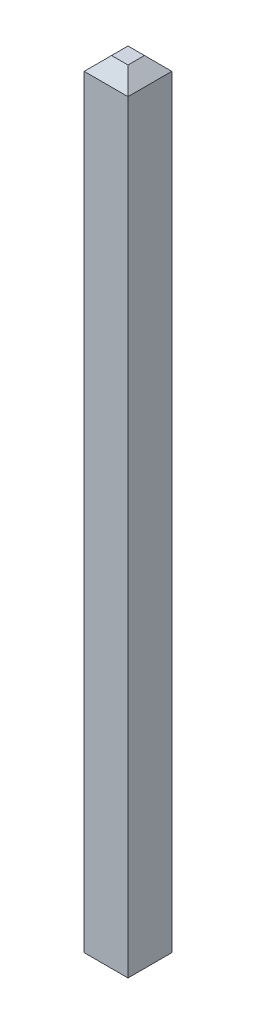
ISO-10303-21;
HEADER;
FILE_DESCRIPTION(('STEP AP214'),'2;1');
FILE_NAME('part.step','',(''),(''),'','','');
FILE_SCHEMA(('AUTOMOTIVE_DESIGN { 1 0 10303 214 1 1 1 1 }'));
ENDSEC;
DATA;
#1=APPLICATION_CONTEXT('core data for automotive mechanical design processes');
#2=APPLICATION_PROTOCOL_DEFINITION('international standard','automotive_design',2000,#1);
#3=PRODUCT_CONTEXT('',#1,'mechanical');
#4=PRODUCT('Part','Part','',(#3));
#5=PRODUCT_RELATED_PRODUCT_CATEGORY('part','',(#4));
#6=PRODUCT_DEFINITION_FORMATION('','',#4);
#7=PRODUCT_DEFINITION_CONTEXT('part definition',#1,'design');
#8=PRODUCT_DEFINITION('design','',#6,#7);
#9=PRODUCT_DEFINITION_SHAPE('','',#8);
#10=(LENGTH_UNIT() NAMED_UNIT(*) SI_UNIT(.MILLI.,.METRE.));
#11=(NAMED_UNIT(*) PLANE_ANGLE_UNIT() SI_UNIT($,.RADIAN.));
#12=(NAMED_UNIT(*) SI_UNIT($,.STERADIAN.) SOLID_ANGLE_UNIT());
#13=UNCERTAINTY_MEASURE_WITH_UNIT(LENGTH_MEASURE(1.E-05),#10,'distance_accuracy_value','');
#14=(GEOMETRIC_REPRESENTATION_CONTEXT(3) GLOBAL_UNCERTAINTY_ASSIGNED_CONTEXT((#13)) GLOBAL_UNIT_ASSIGNED_CONTEXT((#10,
#11,#12)) REPRESENTATION_CONTEXT('',''));
#15=CARTESIAN_POINT('',(0.,0.,0.));
#16=DIRECTION('',(0.,0.,1.));
#17=DIRECTION('',(1.,0.,0.));
#18=AXIS2_PLACEMENT_3D('',#15,#16,#17);
#19=CARTESIAN_POINT('',(1.59,7.07,-0.32));
#20=DIRECTION('',(-0.707106781186548,-0.707106781186548,0.));
#21=DIRECTION('',(-0.707106781186548,0.707106781186548,0.));
#22=AXIS2_PLACEMENT_3D('',#19,#20,#21);
#23=PLANE('',#22);
#24=DIRECTION('',(0.577350269189626,-0.577350269189626,0.577350269189626));
#25=VECTOR('',#24,1.);
#26=CARTESIAN_POINT('',(1.376666666667,7.283333333333,0.106666666667));
#27=LINE('',#26,#25);
#28=CARTESIAN_POINT('',(1.39,7.27,0.12));
#29=VERTEX_POINT('',#28);
#30=CARTESIAN_POINT('',(1.59,7.07,0.32));
#31=VERTEX_POINT('',#30);
#32=EDGE_CURVE('E133',#29,#31,#27,.T.);
#33=ORIENTED_EDGE('',*,*,#32,.T.);
#34=DIRECTION('',(0.,0.,1.));
#35=VECTOR('',#34,1.);
#36=CARTESIAN_POINT('',(1.59,7.07,-0.32));
#37=LINE('',#36,#35);
#38=CARTESIAN_POINT('',(1.59,7.07,-0.32));
#39=VERTEX_POINT('',#38);
#40=EDGE_CURVE('E87',#39,#31,#37,.T.);
#41=ORIENTED_EDGE('',*,*,#40,.F.);
#42=DIRECTION('',(0.577350269189626,-0.577350269189626,-0.577350269189626));
#43=VECTOR('',#42,1.);
#44=CARTESIAN_POINT('',(1.59,7.07,-0.32));
#45=LINE('',#44,#43);
#46=CARTESIAN_POINT('',(1.39,7.27,-0.12));
#47=VERTEX_POINT('',#46);
#48=EDGE_CURVE('E11',#47,#39,#45,.T.);
#49=ORIENTED_EDGE('',*,*,#48,.F.);
#50=DIRECTION('',(0.,0.,-1.));
#51=VECTOR('',#50,1.);
#52=CARTESIAN_POINT('',(1.39,7.27,-0.32));
#53=LINE('',#52,#51);
#54=EDGE_CURVE('E139',#29,#47,#53,.T.);
#55=ORIENTED_EDGE('',*,*,#54,.F.);
#56=EDGE_LOOP('',(#33,#41,#49,#55));
#57=FACE_BOUND('',#56,.T.);
#58=ADVANCED_FACE('F17',(#57),#23,.F.);
#59=CARTESIAN_POINT('',(1.27,7.07,-0.32));
#60=DIRECTION('',(0.,0.707106781186548,-0.707106781186548));
#61=DIRECTION('',(-1.,0.,0.));
#62=AXIS2_PLACEMENT_3D('',#59,#60,#61);
#63=PLANE('',#62);
#64=DIRECTION('',(0.577350269189626,0.577350269189626,0.577350269189626));
#65=VECTOR('',#64,1.);
#66=CARTESIAN_POINT('',(1.083333333333,7.203333333333,-0.186666666667));
#67=LINE('',#66,#65);
#68=CARTESIAN_POINT('',(0.95,7.07,-0.32));
#69=VERTEX_POINT('',#68);
#70=CARTESIAN_POINT('',(1.15,7.27,-0.12));
#71=VERTEX_POINT('',#70);
#72=EDGE_CURVE('E27',#69,#71,#67,.T.);
#73=ORIENTED_EDGE('',*,*,#72,.T.);
#74=DIRECTION('',(-1.,0.,0.));
#75=VECTOR('',#74,1.);
#76=CARTESIAN_POINT('',(0.95,7.27,-0.12));
#77=LINE('',#76,#75);
#78=EDGE_CURVE('E143',#47,#71,#77,.T.);
#79=ORIENTED_EDGE('',*,*,#78,.F.);
#80=ORIENTED_EDGE('',*,*,#48,.T.);
#81=DIRECTION('',(1.,0.,0.));
#82=VECTOR('',#81,1.);
#83=CARTESIAN_POINT('',(1.59,7.07,-0.32));
#84=LINE('',#83,#82);
#85=EDGE_CURVE('E158',#69,#39,#84,.T.);
#86=ORIENTED_EDGE('',*,*,#85,.F.);
#87=EDGE_LOOP('',(#73,#79,#80,#86));
#88=FACE_BOUND('',#87,.T.);
#89=ADVANCED_FACE('F156',(#88),#63,.T.);
#90=CARTESIAN_POINT('',(1.15,7.27,-0.32));
#91=DIRECTION('',(0.707106781186548,-0.707106781186548,0.));
#92=DIRECTION('',(0.,0.,-1.));
#93=AXIS2_PLACEMENT_3D('',#90,#91,#92);
#94=PLANE('',#93);
#95=DIRECTION('',(-0.577350269189626,-0.577350269189626,0.577350269189626));
#96=VECTOR('',#95,1.);
#97=CARTESIAN_POINT('',(1.083333333333,7.203333333333,0.186666666667));
#98=LINE('',#97,#96);
#99=CARTESIAN_POINT('',(1.15,7.27,0.12));
#100=VERTEX_POINT('',#99);
#101=CARTESIAN_POINT('',(0.95,7.07,0.32));
#102=VERTEX_POINT('',#101);
#103=EDGE_CURVE('E39',#100,#102,#98,.T.);
#104=ORIENTED_EDGE('',*,*,#103,.F.);
#105=DIRECTION('',(0.,0.,1.));
#106=VECTOR('',#105,1.);
#107=CARTESIAN_POINT('',(1.15,7.27,-0.32));
#108=LINE('',#107,#106);
#109=EDGE_CURVE('E147',#71,#100,#108,.T.);
#110=ORIENTED_EDGE('',*,*,#109,.F.);
#111=ORIENTED_EDGE('',*,*,#72,.F.);
#112=DIRECTION('',(0.,0.,-1.));
#113=VECTOR('',#112,1.);
#114=CARTESIAN_POINT('',(0.95,7.07,-0.32));
#115=LINE('',#114,#113);
#116=EDGE_CURVE('E214',#102,#69,#115,.T.);
#117=ORIENTED_EDGE('',*,*,#116,.F.);
#118=EDGE_LOOP('',(#104,#110,#111,#117));
#119=FACE_BOUND('',#118,.T.);
#120=ADVANCED_FACE('F19',(#119),#94,.F.);
#121=CARTESIAN_POINT('',(0.95,7.27,0.12));
#122=DIRECTION('',(0.,-0.707106781186548,-0.707106781186548));
#123=DIRECTION('',(0.,-0.707106781186548,0.707106781186548));
#124=AXIS2_PLACEMENT_3D('',#121,#122,#123);
#125=PLANE('',#124);
#126=ORIENTED_EDGE('',*,*,#32,.F.);
#127=DIRECTION('',(1.,0.,0.));
#128=VECTOR('',#127,1.);
#129=CARTESIAN_POINT('',(0.95,7.27,0.12));
#130=LINE('',#129,#128);
#131=EDGE_CURVE('E148',#100,#29,#130,.T.);
#132=ORIENTED_EDGE('',*,*,#131,.F.);
#133=ORIENTED_EDGE('',*,*,#103,.T.);
#134=DIRECTION('',(-1.,0.,0.));
#135=VECTOR('',#134,1.);
#136=CARTESIAN_POINT('',(1.27,7.07,0.32));
#137=LINE('',#136,#135);
#138=EDGE_CURVE('E93',#31,#102,#137,.T.);
#139=ORIENTED_EDGE('',*,*,#138,.F.);
#140=EDGE_LOOP('',(#126,#132,#133,#139));
#141=FACE_BOUND('',#140,.T.);
#142=ADVANCED_FACE('F257',(#141),#125,.F.);
#143=CARTESIAN_POINT('',(0.95,7.27,-0.32));
#144=DIRECTION('',(0.,-1.,0.));
#145=DIRECTION('',(0.,0.,-1.));
#146=AXIS2_PLACEMENT_3D('',#143,#144,#145);
#147=PLANE('',#146);
#148=ORIENTED_EDGE('',*,*,#54,.T.);
#149=ORIENTED_EDGE('',*,*,#78,.T.);
#150=ORIENTED_EDGE('',*,*,#109,.T.);
#151=ORIENTED_EDGE('',*,*,#131,.T.);
#152=EDGE_LOOP('',(#148,#149,#150,#151));
#153=FACE_BOUND('',#152,.T.);
#154=ADVANCED_FACE('F165',(#153),#147,.F.);
#155=CARTESIAN_POINT('',(1.59,7.27,-0.32));
#156=DIRECTION('',(-1.,0.,0.));
#157=DIRECTION('',(0.,1.,0.));
#158=AXIS2_PLACEMENT_3D('',#155,#156,#157);
#159=PLANE('',#158);
#160=DIRECTION('',(0.,-1.,0.));
#161=VECTOR('',#160,1.);
#162=CARTESIAN_POINT('',(1.59,7.27,-0.32));
#163=LINE('',#162,#161);
#164=CARTESIAN_POINT('',(1.59,-4.07,-0.32));
#165=VERTEX_POINT('',#164);
#166=EDGE_CURVE('E225',#39,#165,#163,.T.);
#167=ORIENTED_EDGE('',*,*,#166,.F.);
#168=ORIENTED_EDGE('',*,*,#40,.T.);
#169=DIRECTION('',(0.,-1.,0.));
#170=VECTOR('',#169,1.);
#171=CARTESIAN_POINT('',(1.59,7.27,0.32));
#172=LINE('',#171,#170);
#173=CARTESIAN_POINT('',(1.59,-4.07,0.32));
#174=VERTEX_POINT('',#173);
#175=EDGE_CURVE('E80',#31,#174,#172,.T.);
#176=ORIENTED_EDGE('',*,*,#175,.T.);
#177=DIRECTION('',(0.,0.,-1.));
#178=VECTOR('',#177,1.);
#179=CARTESIAN_POINT('',(1.59,-4.07,-0.32));
#180=LINE('',#179,#178);
#181=EDGE_CURVE('E84',#174,#165,#180,.T.);
#182=ORIENTED_EDGE('',*,*,#181,.T.);
#183=EDGE_LOOP('',(#167,#168,#176,#182));
#184=FACE_BOUND('',#183,.T.);
#185=ADVANCED_FACE('F83',(#184),#159,.F.);
#186=CARTESIAN_POINT('',(1.27,1.5,0.32));
#187=DIRECTION('',(0.,0.,-1.));
#188=DIRECTION('',(0.,-1.,0.));
#189=AXIS2_PLACEMENT_3D('',#186,#187,#188);
#190=PLANE('',#189);
#191=ORIENTED_EDGE('',*,*,#175,.F.);
#192=ORIENTED_EDGE('',*,*,#138,.T.);
#193=DIRECTION('',(0.,1.,0.));
#194=VECTOR('',#193,1.);
#195=CARTESIAN_POINT('',(0.95,-4.27,0.32));
#196=LINE('',#195,#194);
#197=CARTESIAN_POINT('',(0.95,-4.07,0.32));
#198=VERTEX_POINT('',#197);
#199=EDGE_CURVE('E113',#198,#102,#196,.T.);
#200=ORIENTED_EDGE('',*,*,#199,.F.);
#201=DIRECTION('',(1.,0.,0.));
#202=VECTOR('',#201,1.);
#203=CARTESIAN_POINT('',(1.27,-4.07,0.32));
#204=LINE('',#203,#202);
#205=EDGE_CURVE('E108',#198,#174,#204,.T.);
#206=ORIENTED_EDGE('',*,*,#205,.T.);
#207=EDGE_LOOP('',(#191,#192,#200,#206));
#208=FACE_BOUND('',#207,.T.);
#209=ADVANCED_FACE('F111',(#208),#190,.F.);
#210=CARTESIAN_POINT('',(1.39,-4.27,-0.32));
#211=DIRECTION('',(-0.707106781186548,0.707106781186548,0.));
#212=DIRECTION('',(0.,0.,1.));
#213=AXIS2_PLACEMENT_3D('',#210,#211,#212);
#214=PLANE('',#213);
#215=DIRECTION('',(-0.577350269189626,-0.577350269189626,0.577350269189626));
#216=VECTOR('',#215,1.);
#217=CARTESIAN_POINT('',(1.456666666667,-4.203333333333,-0.186666666667));
#218=LINE('',#217,#216);
#219=CARTESIAN_POINT('',(1.39,-4.27,-0.12));
#220=VERTEX_POINT('',#219);
#221=EDGE_CURVE('E105',#165,#220,#218,.T.);
#222=ORIENTED_EDGE('',*,*,#221,.F.);
#223=ORIENTED_EDGE('',*,*,#181,.F.);
#224=DIRECTION('',(-0.577350269189626,-0.577350269189626,-0.577350269189626));
#225=VECTOR('',#224,1.);
#226=CARTESIAN_POINT('',(1.243333333333,-4.416666666667,-0.02666666666667));
#227=LINE('',#226,#225);
#228=CARTESIAN_POINT('',(1.39,-4.27,0.12));
#229=VERTEX_POINT('',#228);
#230=EDGE_CURVE('E102',#174,#229,#227,.T.);
#231=ORIENTED_EDGE('',*,*,#230,.T.);
#232=DIRECTION('',(0.,0.,1.));
#233=VECTOR('',#232,1.);
#234=CARTESIAN_POINT('',(1.39,-4.27,-0.32));
#235=LINE('',#234,#233);
#236=EDGE_CURVE('E211',#220,#229,#235,.T.);
#237=ORIENTED_EDGE('',*,*,#236,.F.);
#238=EDGE_LOOP('',(#222,#223,#231,#237));
#239=FACE_BOUND('',#238,.T.);
#240=ADVANCED_FACE('F98',(#239),#214,.F.);
#241=CARTESIAN_POINT('',(1.59,-4.27,0.12));
#242=DIRECTION('',(0.,0.707106781186548,-0.707106781186548));
#243=DIRECTION('',(-1.,0.,0.));
#244=AXIS2_PLACEMENT_3D('',#241,#242,#243);
#245=PLANE('',#244);
#246=ORIENTED_EDGE('',*,*,#230,.F.);
#247=ORIENTED_EDGE('',*,*,#205,.F.);
#248=DIRECTION('',(-0.577350269189626,0.577350269189626,0.577350269189626));
#249=VECTOR('',#248,1.);
#250=CARTESIAN_POINT('',(1.163333333333,-4.283333333333,0.106666666667));
#251=LINE('',#250,#249);
#252=CARTESIAN_POINT('',(1.15,-4.27,0.12));
#253=VERTEX_POINT('',#252);
#254=EDGE_CURVE('E124',#253,#198,#251,.T.);
#255=ORIENTED_EDGE('',*,*,#254,.F.);
#256=DIRECTION('',(-1.,0.,0.));
#257=VECTOR('',#256,1.);
#258=CARTESIAN_POINT('',(1.59,-4.27,0.12));
#259=LINE('',#258,#257);
#260=EDGE_CURVE('E121',#229,#253,#259,.T.);
#261=ORIENTED_EDGE('',*,*,#260,.F.);
#262=EDGE_LOOP('',(#246,#247,#255,#261));
#263=FACE_BOUND('',#262,.T.);
#264=ADVANCED_FACE('F119',(#263),#245,.F.);
#265=CARTESIAN_POINT('',(0.95,-4.07,-0.32));
#266=DIRECTION('',(0.707106781186548,0.707106781186548,0.));
#267=DIRECTION('',(0.,0.,-1.));
#268=AXIS2_PLACEMENT_3D('',#265,#266,#267);
#269=PLANE('',#268);
#270=DIRECTION('',(0.577350269189626,-0.577350269189626,0.577350269189626));
#271=VECTOR('',#270,1.);
#272=CARTESIAN_POINT('',(1.056666666667,-4.176666666667,-0.213333333333));
#273=LINE('',#272,#271);
#274=CARTESIAN_POINT('',(0.95,-4.07,-0.32));
#275=VERTEX_POINT('',#274);
#276=CARTESIAN_POINT('',(1.15,-4.27,-0.12));
#277=VERTEX_POINT('',#276);
#278=EDGE_CURVE('E188',#275,#277,#273,.T.);
#279=ORIENTED_EDGE('',*,*,#278,.T.);
#280=DIRECTION('',(0.,0.,-1.));
#281=VECTOR('',#280,1.);
#282=CARTESIAN_POINT('',(1.15,-4.27,-0.32));
#283=LINE('',#282,#281);
#284=EDGE_CURVE('E192',#253,#277,#283,.T.);
#285=ORIENTED_EDGE('',*,*,#284,.F.);
#286=ORIENTED_EDGE('',*,*,#254,.T.);
#287=DIRECTION('',(0.,0.,1.));
#288=VECTOR('',#287,1.);
#289=CARTESIAN_POINT('',(0.95,-4.07,-0.32));
#290=LINE('',#289,#288);
#291=EDGE_CURVE('E129',#275,#198,#290,.T.);
#292=ORIENTED_EDGE('',*,*,#291,.F.);
#293=EDGE_LOOP('',(#279,#285,#286,#292));
#294=FACE_BOUND('',#293,.T.);
#295=ADVANCED_FACE('F190',(#294),#269,.F.);
#296=CARTESIAN_POINT('',(0.95,-4.27,-0.32));
#297=DIRECTION('',(1.,0.,0.));
#298=DIRECTION('',(0.,0.,1.));
#299=AXIS2_PLACEMENT_3D('',#296,#297,#298);
#300=PLANE('',#299);
#301=ORIENTED_EDGE('',*,*,#199,.T.);
#302=ORIENTED_EDGE('',*,*,#116,.T.);
#303=DIRECTION('',(0.,1.,0.));
#304=VECTOR('',#303,1.);
#305=CARTESIAN_POINT('',(0.95,-4.27,-0.32));
#306=LINE('',#305,#304);
#307=EDGE_CURVE('E222',#275,#69,#306,.T.);
#308=ORIENTED_EDGE('',*,*,#307,.F.);
#309=ORIENTED_EDGE('',*,*,#291,.T.);
#310=EDGE_LOOP('',(#301,#302,#308,#309));
#311=FACE_BOUND('',#310,.T.);
#312=ADVANCED_FACE('F232',(#311),#300,.F.);
#313=CARTESIAN_POINT('',(1.27,1.5,-0.32));
#314=DIRECTION('',(0.,0.,-1.));
#315=DIRECTION('',(0.,-1.,0.));
#316=AXIS2_PLACEMENT_3D('',#313,#314,#315);
#317=PLANE('',#316);
#318=ORIENTED_EDGE('',*,*,#307,.T.);
#319=ORIENTED_EDGE('',*,*,#85,.T.);
#320=ORIENTED_EDGE('',*,*,#166,.T.);
#321=DIRECTION('',(-1.,0.,0.));
#322=VECTOR('',#321,1.);
#323=CARTESIAN_POINT('',(0.95,-4.07,-0.32));
#324=LINE('',#323,#322);
#325=EDGE_CURVE('E197',#165,#275,#324,.T.);
#326=ORIENTED_EDGE('',*,*,#325,.T.);
#327=EDGE_LOOP('',(#318,#319,#320,#326));
#328=FACE_BOUND('',#327,.T.);
#329=ADVANCED_FACE('F230',(#328),#317,.T.);
#330=CARTESIAN_POINT('',(1.27,-4.07,-0.32));
#331=DIRECTION('',(0.,-0.707106781186548,-0.707106781186548));
#332=DIRECTION('',(0.,-0.707106781186548,0.707106781186548));
#333=AXIS2_PLACEMENT_3D('',#330,#331,#332);
#334=PLANE('',#333);
#335=ORIENTED_EDGE('',*,*,#278,.F.);
#336=ORIENTED_EDGE('',*,*,#325,.F.);
#337=ORIENTED_EDGE('',*,*,#221,.T.);
#338=DIRECTION('',(1.,0.,0.));
#339=VECTOR('',#338,1.);
#340=CARTESIAN_POINT('',(1.59,-4.27,-0.12));
#341=LINE('',#340,#339);
#342=EDGE_CURVE('E198',#277,#220,#341,.T.);
#343=ORIENTED_EDGE('',*,*,#342,.F.);
#344=EDGE_LOOP('',(#335,#336,#337,#343));
#345=FACE_BOUND('',#344,.T.);
#346=ADVANCED_FACE('F201',(#345),#334,.T.);
#347=CARTESIAN_POINT('',(1.59,-4.27,-0.32));
#348=DIRECTION('',(0.,1.,0.));
#349=DIRECTION('',(0.,0.,-1.));
#350=AXIS2_PLACEMENT_3D('',#347,#348,#349);
#351=PLANE('',#350);
#352=ORIENTED_EDGE('',*,*,#236,.T.);
#353=ORIENTED_EDGE('',*,*,#260,.T.);
#354=ORIENTED_EDGE('',*,*,#284,.T.);
#355=ORIENTED_EDGE('',*,*,#342,.T.);
#356=EDGE_LOOP('',(#352,#353,#354,#355));
#357=FACE_BOUND('',#356,.T.);
#358=ADVANCED_FACE('F205',(#357),#351,.F.);
#359=CLOSED_SHELL('',(#58,#89,#120,#142,#154,#185,#209,#240,#264,#295,#312,#329,#346,#358));
#360=MANIFOLD_SOLID_BREP('B1',#359);
#361=ADVANCED_BREP_SHAPE_REPRESENTATION('',(#18,#360),#14);
#362=SHAPE_DEFINITION_REPRESENTATION(#9,#361);
ENDSEC;
END-ISO-10303-21;
